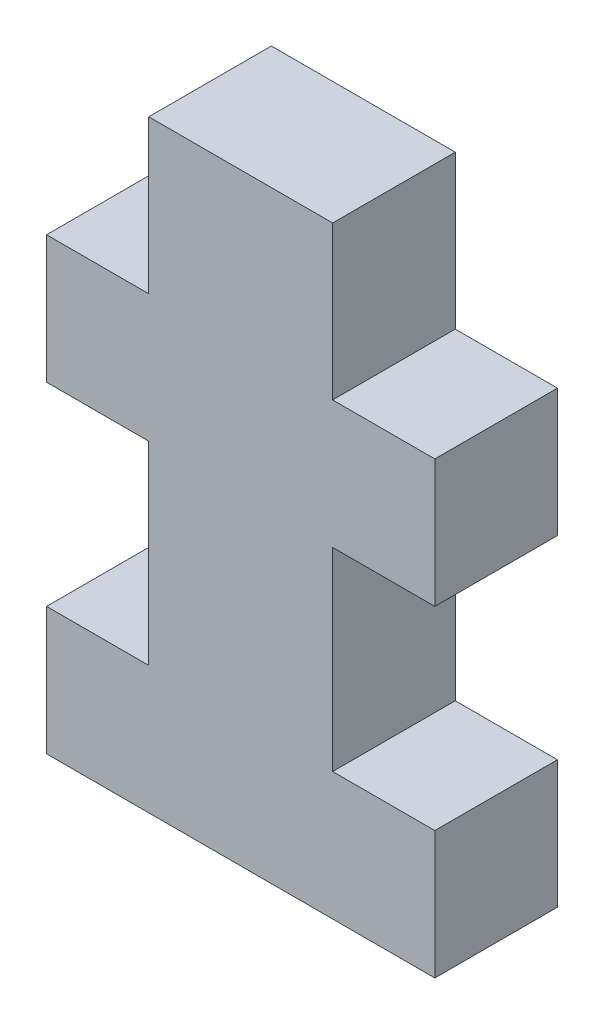
ISO-10303-21;
HEADER;
FILE_DESCRIPTION(('STEP AP214'),'2;1');
FILE_NAME('part.step','',(''),(''),'','','');
FILE_SCHEMA(('AUTOMOTIVE_DESIGN { 1 0 10303 214 1 1 1 1 }'));
ENDSEC;
DATA;
#1=APPLICATION_CONTEXT('core data for automotive mechanical design processes');
#2=APPLICATION_PROTOCOL_DEFINITION('international standard','automotive_design',2000,#1);
#3=PRODUCT_CONTEXT('',#1,'mechanical');
#4=PRODUCT('Part','Part','',(#3));
#5=PRODUCT_RELATED_PRODUCT_CATEGORY('part','',(#4));
#6=PRODUCT_DEFINITION_FORMATION('','',#4);
#7=PRODUCT_DEFINITION_CONTEXT('part definition',#1,'design');
#8=PRODUCT_DEFINITION('design','',#6,#7);
#9=PRODUCT_DEFINITION_SHAPE('','',#8);
#10=(LENGTH_UNIT() NAMED_UNIT(*) SI_UNIT(.MILLI.,.METRE.));
#11=(NAMED_UNIT(*) PLANE_ANGLE_UNIT() SI_UNIT($,.RADIAN.));
#12=(NAMED_UNIT(*) SI_UNIT($,.STERADIAN.) SOLID_ANGLE_UNIT());
#13=UNCERTAINTY_MEASURE_WITH_UNIT(LENGTH_MEASURE(1.E-05),#10,'distance_accuracy_value','');
#14=(GEOMETRIC_REPRESENTATION_CONTEXT(3) GLOBAL_UNCERTAINTY_ASSIGNED_CONTEXT((#13)) GLOBAL_UNIT_ASSIGNED_CONTEXT((#10,
#11,#12)) REPRESENTATION_CONTEXT('',''));
#15=CARTESIAN_POINT('',(0.,0.,0.));
#16=DIRECTION('',(0.,0.,1.));
#17=DIRECTION('',(1.,0.,0.));
#18=AXIS2_PLACEMENT_3D('',#15,#16,#17);
#19=CARTESIAN_POINT('',(4.57199999999999,77.978,3.048));
#20=DIRECTION('',(-1.,0.,0.));
#21=DIRECTION('',(0.,-1.,0.));
#22=AXIS2_PLACEMENT_3D('',#19,#20,#21);
#23=PLANE('',#22);
#24=DIRECTION('',(0.,1.,0.));
#25=VECTOR('',#24,1.);
#26=CARTESIAN_POINT('',(4.57199999999999,77.978,-3.048));
#27=LINE('',#26,#25);
#28=CARTESIAN_POINT('',(4.57199999999999,77.978,-3.048));
#29=VERTEX_POINT('',#28);
#30=CARTESIAN_POINT('',(4.57199999999999,85.598,-3.048));
#31=VERTEX_POINT('',#30);
#32=EDGE_CURVE('E177',#29,#31,#27,.T.);
#33=ORIENTED_EDGE('',*,*,#32,.T.);
#34=DIRECTION('',(0.,0.,-1.));
#35=VECTOR('',#34,1.);
#36=CARTESIAN_POINT('',(4.57199999999999,85.598,3.048));
#37=LINE('',#36,#35);
#38=CARTESIAN_POINT('',(4.57199999999999,85.598,3.048));
#39=VERTEX_POINT('',#38);
#40=EDGE_CURVE('E11',#39,#31,#37,.T.);
#41=ORIENTED_EDGE('',*,*,#40,.F.);
#42=DIRECTION('',(0.,1.,0.));
#43=VECTOR('',#42,1.);
#44=CARTESIAN_POINT('',(4.57199999999999,77.978,3.048));
#45=LINE('',#44,#43);
#46=CARTESIAN_POINT('',(4.57199999999999,77.978,3.048));
#47=VERTEX_POINT('',#46);
#48=EDGE_CURVE('E207',#47,#39,#45,.T.);
#49=ORIENTED_EDGE('',*,*,#48,.F.);
#50=DIRECTION('',(0.,0.,-1.));
#51=VECTOR('',#50,1.);
#52=CARTESIAN_POINT('',(4.57199999999999,77.978,3.048));
#53=LINE('',#52,#51);
#54=EDGE_CURVE('E173',#47,#29,#53,.T.);
#55=ORIENTED_EDGE('',*,*,#54,.T.);
#56=EDGE_LOOP('',(#33,#41,#49,#55));
#57=FACE_BOUND('',#56,.T.);
#58=ADVANCED_FACE('F33',(#57),#23,.F.);
#59=CARTESIAN_POINT('',(4.57199999999999,85.598,3.048));
#60=DIRECTION('',(0.,-1.,0.));
#61=DIRECTION('',(0.,0.,-1.));
#62=AXIS2_PLACEMENT_3D('',#59,#60,#61);
#63=PLANE('',#62);
#64=DIRECTION('',(-1.,0.,0.));
#65=VECTOR('',#64,1.);
#66=CARTESIAN_POINT('',(4.57199999999999,85.598,-3.048));
#67=LINE('',#66,#65);
#68=CARTESIAN_POINT('',(-4.57200000000001,85.598,-3.048));
#69=VERTEX_POINT('',#68);
#70=EDGE_CURVE('E180',#31,#69,#67,.T.);
#71=ORIENTED_EDGE('',*,*,#70,.T.);
#72=DIRECTION('',(0.,0.,-1.));
#73=VECTOR('',#72,1.);
#74=CARTESIAN_POINT('',(-4.57200000000001,85.598,3.048));
#75=LINE('',#74,#73);
#76=CARTESIAN_POINT('',(-4.57200000000001,85.598,3.048));
#77=VERTEX_POINT('',#76);
#78=EDGE_CURVE('E41',#77,#69,#75,.T.);
#79=ORIENTED_EDGE('',*,*,#78,.F.);
#80=DIRECTION('',(-1.,0.,0.));
#81=VECTOR('',#80,1.);
#82=CARTESIAN_POINT('',(4.57199999999999,85.598,3.048));
#83=LINE('',#82,#81);
#84=EDGE_CURVE('E116',#39,#77,#83,.T.);
#85=ORIENTED_EDGE('',*,*,#84,.F.);
#86=ORIENTED_EDGE('',*,*,#40,.T.);
#87=EDGE_LOOP('',(#71,#79,#85,#86));
#88=FACE_BOUND('',#87,.T.);
#89=ADVANCED_FACE('F305',(#88),#63,.F.);
#90=CARTESIAN_POINT('',(-4.572,77.978,3.048));
#91=DIRECTION('',(1.,0.,0.));
#92=DIRECTION('',(0.,1.,0.));
#93=AXIS2_PLACEMENT_3D('',#90,#91,#92);
#94=PLANE('',#93);
#95=DIRECTION('',(0.,-1.,0.));
#96=VECTOR('',#95,1.);
#97=CARTESIAN_POINT('',(-4.572,77.978,-3.048));
#98=LINE('',#97,#96);
#99=CARTESIAN_POINT('',(-4.572,77.978,-3.048));
#100=VERTEX_POINT('',#99);
#101=EDGE_CURVE('E182',#69,#100,#98,.T.);
#102=ORIENTED_EDGE('',*,*,#101,.T.);
#103=DIRECTION('',(0.,0.,-1.));
#104=VECTOR('',#103,1.);
#105=CARTESIAN_POINT('',(-4.572,77.978,3.048));
#106=LINE('',#105,#104);
#107=CARTESIAN_POINT('',(-4.572,77.978,3.048));
#108=VERTEX_POINT('',#107);
#109=EDGE_CURVE('E238',#108,#100,#106,.T.);
#110=ORIENTED_EDGE('',*,*,#109,.F.);
#111=DIRECTION('',(0.,-1.,0.));
#112=VECTOR('',#111,1.);
#113=CARTESIAN_POINT('',(-4.572,77.978,3.048));
#114=LINE('',#113,#112);
#115=EDGE_CURVE('E246',#77,#108,#114,.T.);
#116=ORIENTED_EDGE('',*,*,#115,.F.);
#117=ORIENTED_EDGE('',*,*,#78,.T.);
#118=EDGE_LOOP('',(#102,#110,#116,#117));
#119=FACE_BOUND('',#118,.T.);
#120=ADVANCED_FACE('F244',(#119),#94,.F.);
#121=CARTESIAN_POINT('',(-4.572,77.978,3.048));
#122=DIRECTION('',(0.,-1.,0.));
#123=DIRECTION('',(0.,0.,-1.));
#124=AXIS2_PLACEMENT_3D('',#121,#122,#123);
#125=PLANE('',#124);
#126=DIRECTION('',(-1.,0.,0.));
#127=VECTOR('',#126,1.);
#128=CARTESIAN_POINT('',(-4.572,77.978,-3.048));
#129=LINE('',#128,#127);
#130=CARTESIAN_POINT('',(-9.652,77.978,-3.048));
#131=VERTEX_POINT('',#130);
#132=EDGE_CURVE('E184',#100,#131,#129,.T.);
#133=ORIENTED_EDGE('',*,*,#132,.T.);
#134=DIRECTION('',(0.,0.,-1.));
#135=VECTOR('',#134,1.);
#136=CARTESIAN_POINT('',(-9.652,77.978,3.048));
#137=LINE('',#136,#135);
#138=CARTESIAN_POINT('',(-9.652,77.978,3.048));
#139=VERTEX_POINT('',#138);
#140=EDGE_CURVE('E235',#139,#131,#137,.T.);
#141=ORIENTED_EDGE('',*,*,#140,.F.);
#142=DIRECTION('',(-1.,0.,0.));
#143=VECTOR('',#142,1.);
#144=CARTESIAN_POINT('',(-4.572,77.978,3.048));
#145=LINE('',#144,#143);
#146=EDGE_CURVE('E264',#108,#139,#145,.T.);
#147=ORIENTED_EDGE('',*,*,#146,.F.);
#148=ORIENTED_EDGE('',*,*,#109,.T.);
#149=EDGE_LOOP('',(#133,#141,#147,#148));
#150=FACE_BOUND('',#149,.T.);
#151=ADVANCED_FACE('F255',(#150),#125,.F.);
#152=CARTESIAN_POINT('',(-9.652,77.978,3.048));
#153=DIRECTION('',(1.,0.,0.));
#154=DIRECTION('',(0.,1.,0.));
#155=AXIS2_PLACEMENT_3D('',#152,#153,#154);
#156=PLANE('',#155);
#157=DIRECTION('',(0.,-1.,0.));
#158=VECTOR('',#157,1.);
#159=CARTESIAN_POINT('',(-9.652,77.978,-3.048));
#160=LINE('',#159,#158);
#161=CARTESIAN_POINT('',(-9.652,71.628,-3.048));
#162=VERTEX_POINT('',#161);
#163=EDGE_CURVE('E186',#131,#162,#160,.T.);
#164=ORIENTED_EDGE('',*,*,#163,.T.);
#165=DIRECTION('',(0.,0.,-1.));
#166=VECTOR('',#165,1.);
#167=CARTESIAN_POINT('',(-9.652,71.628,3.048));
#168=LINE('',#167,#166);
#169=CARTESIAN_POINT('',(-9.652,71.628,3.048));
#170=VERTEX_POINT('',#169);
#171=EDGE_CURVE('E232',#170,#162,#168,.T.);
#172=ORIENTED_EDGE('',*,*,#171,.F.);
#173=DIRECTION('',(0.,-1.,0.));
#174=VECTOR('',#173,1.);
#175=CARTESIAN_POINT('',(-9.652,77.978,3.048));
#176=LINE('',#175,#174);
#177=EDGE_CURVE('E261',#139,#170,#176,.T.);
#178=ORIENTED_EDGE('',*,*,#177,.F.);
#179=ORIENTED_EDGE('',*,*,#140,.T.);
#180=EDGE_LOOP('',(#164,#172,#178,#179));
#181=FACE_BOUND('',#180,.T.);
#182=ADVANCED_FACE('F259',(#181),#156,.F.);
#183=CARTESIAN_POINT('',(-4.572,71.628,3.048));
#184=DIRECTION('',(0.,1.,0.));
#185=DIRECTION('',(0.,0.,1.));
#186=AXIS2_PLACEMENT_3D('',#183,#184,#185);
#187=PLANE('',#186);
#188=DIRECTION('',(1.,0.,0.));
#189=VECTOR('',#188,1.);
#190=CARTESIAN_POINT('',(-4.572,71.628,-3.048));
#191=LINE('',#190,#189);
#192=CARTESIAN_POINT('',(-4.572,71.628,-3.048));
#193=VERTEX_POINT('',#192);
#194=EDGE_CURVE('E188',#162,#193,#191,.T.);
#195=ORIENTED_EDGE('',*,*,#194,.T.);
#196=DIRECTION('',(0.,0.,-1.));
#197=VECTOR('',#196,1.);
#198=CARTESIAN_POINT('',(-4.572,71.628,3.048));
#199=LINE('',#198,#197);
#200=CARTESIAN_POINT('',(-4.572,71.628,3.048));
#201=VERTEX_POINT('',#200);
#202=EDGE_CURVE('E229',#201,#193,#199,.T.);
#203=ORIENTED_EDGE('',*,*,#202,.F.);
#204=DIRECTION('',(1.,0.,0.));
#205=VECTOR('',#204,1.);
#206=CARTESIAN_POINT('',(-4.572,71.628,3.048));
#207=LINE('',#206,#205);
#208=EDGE_CURVE('E263',#170,#201,#207,.T.);
#209=ORIENTED_EDGE('',*,*,#208,.F.);
#210=ORIENTED_EDGE('',*,*,#171,.T.);
#211=EDGE_LOOP('',(#195,#203,#209,#210));
#212=FACE_BOUND('',#211,.T.);
#213=ADVANCED_FACE('F318',(#212),#187,.F.);
#214=CARTESIAN_POINT('',(-4.572,61.976,3.048));
#215=DIRECTION('',(1.,0.,0.));
#216=DIRECTION('',(0.,1.,0.));
#217=AXIS2_PLACEMENT_3D('',#214,#215,#216);
#218=PLANE('',#217);
#219=DIRECTION('',(0.,-1.,0.));
#220=VECTOR('',#219,1.);
#221=CARTESIAN_POINT('',(-4.572,61.976,-3.048));
#222=LINE('',#221,#220);
#223=CARTESIAN_POINT('',(-4.572,61.976,-3.048));
#224=VERTEX_POINT('',#223);
#225=EDGE_CURVE('E190',#193,#224,#222,.T.);
#226=ORIENTED_EDGE('',*,*,#225,.T.);
#227=DIRECTION('',(0.,0.,-1.));
#228=VECTOR('',#227,1.);
#229=CARTESIAN_POINT('',(-4.572,61.976,3.048));
#230=LINE('',#229,#228);
#231=CARTESIAN_POINT('',(-4.572,61.976,3.048));
#232=VERTEX_POINT('',#231);
#233=EDGE_CURVE('E226',#232,#224,#230,.T.);
#234=ORIENTED_EDGE('',*,*,#233,.F.);
#235=DIRECTION('',(0.,-1.,0.));
#236=VECTOR('',#235,1.);
#237=CARTESIAN_POINT('',(-4.572,61.976,3.048));
#238=LINE('',#237,#236);
#239=EDGE_CURVE('E266',#201,#232,#238,.T.);
#240=ORIENTED_EDGE('',*,*,#239,.F.);
#241=ORIENTED_EDGE('',*,*,#202,.T.);
#242=EDGE_LOOP('',(#226,#234,#240,#241));
#243=FACE_BOUND('',#242,.T.);
#244=ADVANCED_FACE('F321',(#243),#218,.F.);
#245=CARTESIAN_POINT('',(-4.572,61.976,3.048));
#246=DIRECTION('',(0.,-1.,0.));
#247=DIRECTION('',(0.,0.,-1.));
#248=AXIS2_PLACEMENT_3D('',#245,#246,#247);
#249=PLANE('',#248);
#250=DIRECTION('',(-1.,0.,0.));
#251=VECTOR('',#250,1.);
#252=CARTESIAN_POINT('',(-4.572,61.976,-3.048));
#253=LINE('',#252,#251);
#254=CARTESIAN_POINT('',(-9.652,61.976,-3.048));
#255=VERTEX_POINT('',#254);
#256=EDGE_CURVE('E192',#224,#255,#253,.T.);
#257=ORIENTED_EDGE('',*,*,#256,.T.);
#258=DIRECTION('',(0.,0.,-1.));
#259=VECTOR('',#258,1.);
#260=CARTESIAN_POINT('',(-9.652,61.976,3.048));
#261=LINE('',#260,#259);
#262=CARTESIAN_POINT('',(-9.652,61.976,3.048));
#263=VERTEX_POINT('',#262);
#264=EDGE_CURVE('E223',#263,#255,#261,.T.);
#265=ORIENTED_EDGE('',*,*,#264,.F.);
#266=DIRECTION('',(-1.,0.,0.));
#267=VECTOR('',#266,1.);
#268=CARTESIAN_POINT('',(-4.572,61.976,3.048));
#269=LINE('',#268,#267);
#270=EDGE_CURVE('E272',#232,#263,#269,.T.);
#271=ORIENTED_EDGE('',*,*,#270,.F.);
#272=ORIENTED_EDGE('',*,*,#233,.T.);
#273=EDGE_LOOP('',(#257,#265,#271,#272));
#274=FACE_BOUND('',#273,.T.);
#275=ADVANCED_FACE('F325',(#274),#249,.F.);
#276=CARTESIAN_POINT('',(-9.652,61.976,3.048));
#277=DIRECTION('',(1.,0.,0.));
#278=DIRECTION('',(0.,1.,0.));
#279=AXIS2_PLACEMENT_3D('',#276,#277,#278);
#280=PLANE('',#279);
#281=DIRECTION('',(0.,-1.,0.));
#282=VECTOR('',#281,1.);
#283=CARTESIAN_POINT('',(-9.652,61.976,-3.048));
#284=LINE('',#283,#282);
#285=CARTESIAN_POINT('',(-9.652,55.626,-3.048));
#286=VERTEX_POINT('',#285);
#287=EDGE_CURVE('E194',#255,#286,#284,.T.);
#288=ORIENTED_EDGE('',*,*,#287,.T.);
#289=DIRECTION('',(0.,0.,-1.));
#290=VECTOR('',#289,1.);
#291=CARTESIAN_POINT('',(-9.652,55.626,3.048));
#292=LINE('',#291,#290);
#293=CARTESIAN_POINT('',(-9.652,55.626,3.048));
#294=VERTEX_POINT('',#293);
#295=EDGE_CURVE('E220',#294,#286,#292,.T.);
#296=ORIENTED_EDGE('',*,*,#295,.F.);
#297=DIRECTION('',(0.,-1.,0.));
#298=VECTOR('',#297,1.);
#299=CARTESIAN_POINT('',(-9.652,61.976,3.048));
#300=LINE('',#299,#298);
#301=EDGE_CURVE('E274',#263,#294,#300,.T.);
#302=ORIENTED_EDGE('',*,*,#301,.F.);
#303=ORIENTED_EDGE('',*,*,#264,.T.);
#304=EDGE_LOOP('',(#288,#296,#302,#303));
#305=FACE_BOUND('',#304,.T.);
#306=ADVANCED_FACE('F329',(#305),#280,.F.);
#307=CARTESIAN_POINT('',(9.652,55.626,3.048));
#308=DIRECTION('',(0.,1.,0.));
#309=DIRECTION('',(0.,0.,1.));
#310=AXIS2_PLACEMENT_3D('',#307,#308,#309);
#311=PLANE('',#310);
#312=DIRECTION('',(1.,0.,0.));
#313=VECTOR('',#312,1.);
#314=CARTESIAN_POINT('',(9.652,55.626,-3.048));
#315=LINE('',#314,#313);
#316=CARTESIAN_POINT('',(9.652,55.626,-3.048));
#317=VERTEX_POINT('',#316);
#318=EDGE_CURVE('E196',#286,#317,#315,.T.);
#319=ORIENTED_EDGE('',*,*,#318,.T.);
#320=DIRECTION('',(0.,0.,-1.));
#321=VECTOR('',#320,1.);
#322=CARTESIAN_POINT('',(9.652,55.626,3.048));
#323=LINE('',#322,#321);
#324=CARTESIAN_POINT('',(9.652,55.626,3.048));
#325=VERTEX_POINT('',#324);
#326=EDGE_CURVE('E217',#325,#317,#323,.T.);
#327=ORIENTED_EDGE('',*,*,#326,.F.);
#328=DIRECTION('',(1.,0.,0.));
#329=VECTOR('',#328,1.);
#330=CARTESIAN_POINT('',(9.652,55.626,3.048));
#331=LINE('',#330,#329);
#332=EDGE_CURVE('E276',#294,#325,#331,.T.);
#333=ORIENTED_EDGE('',*,*,#332,.F.);
#334=ORIENTED_EDGE('',*,*,#295,.T.);
#335=EDGE_LOOP('',(#319,#327,#333,#334));
#336=FACE_BOUND('',#335,.T.);
#337=ADVANCED_FACE('F333',(#336),#311,.F.);
#338=CARTESIAN_POINT('',(9.652,61.976,3.048));
#339=DIRECTION('',(-1.,0.,0.));
#340=DIRECTION('',(0.,0.,1.));
#341=AXIS2_PLACEMENT_3D('',#338,#339,#340);
#342=PLANE('',#341);
#343=DIRECTION('',(0.,1.,0.));
#344=VECTOR('',#343,1.);
#345=CARTESIAN_POINT('',(9.652,61.976,-3.048));
#346=LINE('',#345,#344);
#347=CARTESIAN_POINT('',(9.652,61.976,-3.048));
#348=VERTEX_POINT('',#347);
#349=EDGE_CURVE('E198',#317,#348,#346,.T.);
#350=ORIENTED_EDGE('',*,*,#349,.T.);
#351=DIRECTION('',(0.,0.,-1.));
#352=VECTOR('',#351,1.);
#353=CARTESIAN_POINT('',(9.652,61.976,3.048));
#354=LINE('',#353,#352);
#355=CARTESIAN_POINT('',(9.652,61.976,3.048));
#356=VERTEX_POINT('',#355);
#357=EDGE_CURVE('E214',#356,#348,#354,.T.);
#358=ORIENTED_EDGE('',*,*,#357,.F.);
#359=DIRECTION('',(0.,1.,0.));
#360=VECTOR('',#359,1.);
#361=CARTESIAN_POINT('',(9.652,61.976,3.048));
#362=LINE('',#361,#360);
#363=EDGE_CURVE('E278',#325,#356,#362,.T.);
#364=ORIENTED_EDGE('',*,*,#363,.F.);
#365=ORIENTED_EDGE('',*,*,#326,.T.);
#366=EDGE_LOOP('',(#350,#358,#364,#365));
#367=FACE_BOUND('',#366,.T.);
#368=ADVANCED_FACE('F337',(#367),#342,.F.);
#369=CARTESIAN_POINT('',(9.652,61.976,3.048));
#370=DIRECTION('',(0.,-1.,0.));
#371=DIRECTION('',(0.,0.,-1.));
#372=AXIS2_PLACEMENT_3D('',#369,#370,#371);
#373=PLANE('',#372);
#374=DIRECTION('',(-1.,0.,0.));
#375=VECTOR('',#374,1.);
#376=CARTESIAN_POINT('',(9.652,61.976,-3.048));
#377=LINE('',#376,#375);
#378=CARTESIAN_POINT('',(4.572,61.976,-3.048));
#379=VERTEX_POINT('',#378);
#380=EDGE_CURVE('E200',#348,#379,#377,.T.);
#381=ORIENTED_EDGE('',*,*,#380,.T.);
#382=DIRECTION('',(0.,0.,-1.));
#383=VECTOR('',#382,1.);
#384=CARTESIAN_POINT('',(4.572,61.976,3.048));
#385=LINE('',#384,#383);
#386=CARTESIAN_POINT('',(4.572,61.976,3.048));
#387=VERTEX_POINT('',#386);
#388=EDGE_CURVE('E211',#387,#379,#385,.T.);
#389=ORIENTED_EDGE('',*,*,#388,.F.);
#390=DIRECTION('',(-1.,0.,0.));
#391=VECTOR('',#390,1.);
#392=CARTESIAN_POINT('',(9.652,61.976,3.048));
#393=LINE('',#392,#391);
#394=EDGE_CURVE('E280',#356,#387,#393,.T.);
#395=ORIENTED_EDGE('',*,*,#394,.F.);
#396=ORIENTED_EDGE('',*,*,#357,.T.);
#397=EDGE_LOOP('',(#381,#389,#395,#396));
#398=FACE_BOUND('',#397,.T.);
#399=ADVANCED_FACE('F286',(#398),#373,.F.);
#400=CARTESIAN_POINT('',(4.572,61.976,3.048));
#401=DIRECTION('',(-1.,0.,0.));
#402=DIRECTION('',(0.,-1.,0.));
#403=AXIS2_PLACEMENT_3D('',#400,#401,#402);
#404=PLANE('',#403);
#405=DIRECTION('',(0.,1.,0.));
#406=VECTOR('',#405,1.);
#407=CARTESIAN_POINT('',(4.572,61.976,-3.048));
#408=LINE('',#407,#406);
#409=CARTESIAN_POINT('',(4.572,71.628,-3.048));
#410=VERTEX_POINT('',#409);
#411=EDGE_CURVE('E202',#379,#410,#408,.T.);
#412=ORIENTED_EDGE('',*,*,#411,.T.);
#413=DIRECTION('',(0.,0.,-1.));
#414=VECTOR('',#413,1.);
#415=CARTESIAN_POINT('',(4.572,71.628,3.048));
#416=LINE('',#415,#414);
#417=CARTESIAN_POINT('',(4.572,71.628,3.048));
#418=VERTEX_POINT('',#417);
#419=EDGE_CURVE('E168',#418,#410,#416,.T.);
#420=ORIENTED_EDGE('',*,*,#419,.F.);
#421=DIRECTION('',(0.,1.,0.));
#422=VECTOR('',#421,1.);
#423=CARTESIAN_POINT('',(4.572,61.976,3.048));
#424=LINE('',#423,#422);
#425=EDGE_CURVE('E159',#387,#418,#424,.T.);
#426=ORIENTED_EDGE('',*,*,#425,.F.);
#427=ORIENTED_EDGE('',*,*,#388,.T.);
#428=EDGE_LOOP('',(#412,#420,#426,#427));
#429=FACE_BOUND('',#428,.T.);
#430=ADVANCED_FACE('F290',(#429),#404,.F.);
#431=CARTESIAN_POINT('',(9.652,71.628,3.048));
#432=DIRECTION('',(0.,1.,0.));
#433=DIRECTION('',(0.,0.,1.));
#434=AXIS2_PLACEMENT_3D('',#431,#432,#433);
#435=PLANE('',#434);
#436=DIRECTION('',(1.,0.,0.));
#437=VECTOR('',#436,1.);
#438=CARTESIAN_POINT('',(9.652,71.628,-3.048));
#439=LINE('',#438,#437);
#440=CARTESIAN_POINT('',(9.652,71.628,-3.048));
#441=VERTEX_POINT('',#440);
#442=EDGE_CURVE('E167',#410,#441,#439,.T.);
#443=ORIENTED_EDGE('',*,*,#442,.T.);
#444=DIRECTION('',(0.,0.,-1.));
#445=VECTOR('',#444,1.);
#446=CARTESIAN_POINT('',(9.652,71.628,3.048));
#447=LINE('',#446,#445);
#448=CARTESIAN_POINT('',(9.652,71.628,3.048));
#449=VERTEX_POINT('',#448);
#450=EDGE_CURVE('E164',#449,#441,#447,.T.);
#451=ORIENTED_EDGE('',*,*,#450,.F.);
#452=DIRECTION('',(1.,0.,0.));
#453=VECTOR('',#452,1.);
#454=CARTESIAN_POINT('',(9.652,71.628,3.048));
#455=LINE('',#454,#453);
#456=EDGE_CURVE('E153',#418,#449,#455,.T.);
#457=ORIENTED_EDGE('',*,*,#456,.F.);
#458=ORIENTED_EDGE('',*,*,#419,.T.);
#459=EDGE_LOOP('',(#443,#451,#457,#458));
#460=FACE_BOUND('',#459,.T.);
#461=ADVANCED_FACE('F165',(#460),#435,.F.);
#462=CARTESIAN_POINT('',(9.652,77.978,3.048));
#463=DIRECTION('',(-1.,0.,0.));
#464=DIRECTION('',(0.,0.,1.));
#465=AXIS2_PLACEMENT_3D('',#462,#463,#464);
#466=PLANE('',#465);
#467=DIRECTION('',(0.,1.,0.));
#468=VECTOR('',#467,1.);
#469=CARTESIAN_POINT('',(9.652,77.978,-3.048));
#470=LINE('',#469,#468);
#471=CARTESIAN_POINT('',(9.652,77.978,-3.048));
#472=VERTEX_POINT('',#471);
#473=EDGE_CURVE('E102',#441,#472,#470,.T.);
#474=ORIENTED_EDGE('',*,*,#473,.T.);
#475=DIRECTION('',(0.,0.,-1.));
#476=VECTOR('',#475,1.);
#477=CARTESIAN_POINT('',(9.652,77.978,3.048));
#478=LINE('',#477,#476);
#479=CARTESIAN_POINT('',(9.652,77.978,3.048));
#480=VERTEX_POINT('',#479);
#481=EDGE_CURVE('E169',#480,#472,#478,.T.);
#482=ORIENTED_EDGE('',*,*,#481,.F.);
#483=DIRECTION('',(0.,1.,0.));
#484=VECTOR('',#483,1.);
#485=CARTESIAN_POINT('',(9.652,77.978,3.048));
#486=LINE('',#485,#484);
#487=EDGE_CURVE('E157',#449,#480,#486,.T.);
#488=ORIENTED_EDGE('',*,*,#487,.F.);
#489=ORIENTED_EDGE('',*,*,#450,.T.);
#490=EDGE_LOOP('',(#474,#482,#488,#489));
#491=FACE_BOUND('',#490,.T.);
#492=ADVANCED_FACE('F171',(#491),#466,.F.);
#493=CARTESIAN_POINT('',(9.652,77.978,3.048));
#494=DIRECTION('',(0.,-1.,0.));
#495=DIRECTION('',(0.,0.,-1.));
#496=AXIS2_PLACEMENT_3D('',#493,#494,#495);
#497=PLANE('',#496);
#498=DIRECTION('',(-1.,0.,0.));
#499=VECTOR('',#498,1.);
#500=CARTESIAN_POINT('',(9.652,77.978,-3.048));
#501=LINE('',#500,#499);
#502=EDGE_CURVE('E108',#472,#29,#501,.T.);
#503=ORIENTED_EDGE('',*,*,#502,.T.);
#504=ORIENTED_EDGE('',*,*,#54,.F.);
#505=DIRECTION('',(-1.,0.,0.));
#506=VECTOR('',#505,1.);
#507=CARTESIAN_POINT('',(9.652,77.978,3.048));
#508=LINE('',#507,#506);
#509=EDGE_CURVE('E49',#480,#47,#508,.T.);
#510=ORIENTED_EDGE('',*,*,#509,.F.);
#511=ORIENTED_EDGE('',*,*,#481,.T.);
#512=EDGE_LOOP('',(#503,#504,#510,#511));
#513=FACE_BOUND('',#512,.T.);
#514=ADVANCED_FACE('F294',(#513),#497,.F.);
#515=CARTESIAN_POINT('',(0.,0.,3.048));
#516=DIRECTION('',(0.,0.,1.));
#517=DIRECTION('',(1.,0.,0.));
#518=AXIS2_PLACEMENT_3D('',#515,#516,#517);
#519=PLANE('',#518);
#520=ORIENTED_EDGE('',*,*,#48,.T.);
#521=ORIENTED_EDGE('',*,*,#84,.T.);
#522=ORIENTED_EDGE('',*,*,#115,.T.);
#523=ORIENTED_EDGE('',*,*,#146,.T.);
#524=ORIENTED_EDGE('',*,*,#177,.T.);
#525=ORIENTED_EDGE('',*,*,#208,.T.);
#526=ORIENTED_EDGE('',*,*,#239,.T.);
#527=ORIENTED_EDGE('',*,*,#270,.T.);
#528=ORIENTED_EDGE('',*,*,#301,.T.);
#529=ORIENTED_EDGE('',*,*,#332,.T.);
#530=ORIENTED_EDGE('',*,*,#363,.T.);
#531=ORIENTED_EDGE('',*,*,#394,.T.);
#532=ORIENTED_EDGE('',*,*,#425,.T.);
#533=ORIENTED_EDGE('',*,*,#456,.T.);
#534=ORIENTED_EDGE('',*,*,#487,.T.);
#535=ORIENTED_EDGE('',*,*,#509,.T.);
#536=EDGE_LOOP('',(#520,#521,#522,#523,#524,#525,#526,#527,#528,#529,#530,#531,#532,#533,#534,#535));
#537=FACE_BOUND('',#536,.T.);
#538=ADVANCED_FACE('F155',(#537),#519,.T.);
#539=CARTESIAN_POINT('',(0.,0.,-3.048));
#540=DIRECTION('',(0.,0.,1.));
#541=DIRECTION('',(1.,0.,0.));
#542=AXIS2_PLACEMENT_3D('',#539,#540,#541);
#543=PLANE('',#542);
#544=ORIENTED_EDGE('',*,*,#32,.F.);
#545=ORIENTED_EDGE('',*,*,#502,.F.);
#546=ORIENTED_EDGE('',*,*,#473,.F.);
#547=ORIENTED_EDGE('',*,*,#442,.F.);
#548=ORIENTED_EDGE('',*,*,#411,.F.);
#549=ORIENTED_EDGE('',*,*,#380,.F.);
#550=ORIENTED_EDGE('',*,*,#349,.F.);
#551=ORIENTED_EDGE('',*,*,#318,.F.);
#552=ORIENTED_EDGE('',*,*,#287,.F.);
#553=ORIENTED_EDGE('',*,*,#256,.F.);
#554=ORIENTED_EDGE('',*,*,#225,.F.);
#555=ORIENTED_EDGE('',*,*,#194,.F.);
#556=ORIENTED_EDGE('',*,*,#163,.F.);
#557=ORIENTED_EDGE('',*,*,#132,.F.);
#558=ORIENTED_EDGE('',*,*,#101,.F.);
#559=ORIENTED_EDGE('',*,*,#70,.F.);
#560=EDGE_LOOP('',(#544,#545,#546,#547,#548,#549,#550,#551,#552,#553,#554,#555,#556,#557,#558,#559));
#561=FACE_BOUND('',#560,.T.);
#562=ADVANCED_FACE('F250',(#561),#543,.F.);
#563=CLOSED_SHELL('',(#58,#89,#120,#151,#182,#213,#244,#275,#306,#337,#368,#399,#430,#461,#492,
#514,#538,#562));
#564=MANIFOLD_SOLID_BREP('B2',#563);
#565=ADVANCED_BREP_SHAPE_REPRESENTATION('',(#18,#564),#14);
#566=SHAPE_DEFINITION_REPRESENTATION(#9,#565);
ENDSEC;
END-ISO-10303-21;
